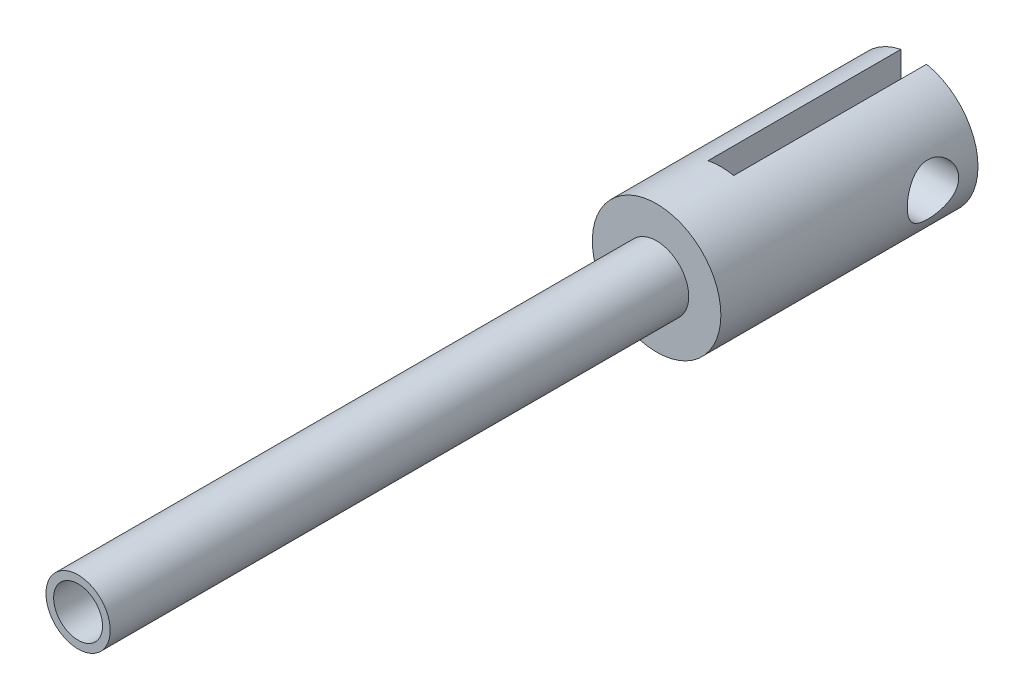
ISO-10303-21;
HEADER;
FILE_DESCRIPTION(('STEP AP214'),'2;1');
FILE_NAME('part.step','',(''),(''),'','','');
FILE_SCHEMA(('AUTOMOTIVE_DESIGN { 1 0 10303 214 1 1 1 1 }'));
ENDSEC;
DATA;
#1=APPLICATION_CONTEXT('core data for automotive mechanical design processes');
#2=APPLICATION_PROTOCOL_DEFINITION('international standard','automotive_design',2000,#1);
#3=PRODUCT_CONTEXT('',#1,'mechanical');
#4=PRODUCT('Part','Part','',(#3));
#5=PRODUCT_RELATED_PRODUCT_CATEGORY('part','',(#4));
#6=PRODUCT_DEFINITION_FORMATION('','',#4);
#7=PRODUCT_DEFINITION_CONTEXT('part definition',#1,'design');
#8=PRODUCT_DEFINITION('design','',#6,#7);
#9=PRODUCT_DEFINITION_SHAPE('','',#8);
#10=(LENGTH_UNIT() NAMED_UNIT(*) SI_UNIT(.MILLI.,.METRE.));
#11=(NAMED_UNIT(*) PLANE_ANGLE_UNIT() SI_UNIT($,.RADIAN.));
#12=(NAMED_UNIT(*) SI_UNIT($,.STERADIAN.) SOLID_ANGLE_UNIT());
#13=UNCERTAINTY_MEASURE_WITH_UNIT(LENGTH_MEASURE(1.E-05),#10,'distance_accuracy_value','');
#14=(GEOMETRIC_REPRESENTATION_CONTEXT(3) GLOBAL_UNCERTAINTY_ASSIGNED_CONTEXT((#13)) GLOBAL_UNIT_ASSIGNED_CONTEXT((#10,
#11,#12)) REPRESENTATION_CONTEXT('',''));
#15=CARTESIAN_POINT('',(0.,0.,0.));
#16=DIRECTION('',(0.,0.,1.));
#17=DIRECTION('',(1.,0.,0.));
#18=AXIS2_PLACEMENT_3D('',#15,#16,#17);
#19=CARTESIAN_POINT('',(0.,0.,40.));
#20=DIRECTION('',(0.,0.,-1.));
#21=DIRECTION('',(-1.,0.,0.));
#22=AXIS2_PLACEMENT_3D('',#19,#20,#21);
#23=CYLINDRICAL_SURFACE('',#22,10.);
#24=CARTESIAN_POINT('',(0.,0.,40.));
#25=DIRECTION('',(0.,0.,1.));
#26=DIRECTION('',(1.,0.,0.));
#27=AXIS2_PLACEMENT_3D('',#24,#25,#26);
#28=CIRCLE('',#27,10.);
#29=CARTESIAN_POINT('',(10.,0.,40.));
#30=VERTEX_POINT('',#29);
#31=EDGE_CURVE('E85',#30,#30,#28,.T.);
#32=ORIENTED_EDGE('',*,*,#31,.F.);
#33=EDGE_LOOP('',(#32));
#34=FACE_BOUND('',#33,.T.);
#35=DIRECTION('',(0.,0.,-1.));
#36=VECTOR('',#35,1.);
#37=CARTESIAN_POINT('',(2.,-9.79795897113271,40.));
#38=LINE('',#37,#36);
#39=CARTESIAN_POINT('',(2.,-9.79795897113272,0.));
#40=VERTEX_POINT('',#39);
#41=CARTESIAN_POINT('',(2.,-9.79795897113272,30.));
#42=VERTEX_POINT('',#41);
#43=EDGE_CURVE('E112',#40,#42,#38,.F.);
#44=ORIENTED_EDGE('',*,*,#43,.F.);
#45=CARTESIAN_POINT('',(0.,0.,0.));
#46=DIRECTION('',(0.,0.,1.));
#47=DIRECTION('',(1.,0.,0.));
#48=AXIS2_PLACEMENT_3D('',#45,#46,#47);
#49=CIRCLE('',#48,10.);
#50=CARTESIAN_POINT('',(2.,9.79795897113271,0.));
#51=VERTEX_POINT('',#50);
#52=EDGE_CURVE('E96',#40,#51,#49,.T.);
#53=ORIENTED_EDGE('',*,*,#52,.T.);
#54=DIRECTION('',(0.,0.,-1.));
#55=VECTOR('',#54,1.);
#56=CARTESIAN_POINT('',(2.,9.79795897113271,40.));
#57=LINE('',#56,#55);
#58=CARTESIAN_POINT('',(2.,9.79795897113271,30.));
#59=VERTEX_POINT('',#58);
#60=EDGE_CURVE('E101',#59,#51,#57,.T.);
#61=ORIENTED_EDGE('',*,*,#60,.F.);
#62=CARTESIAN_POINT('',(0.,0.,30.));
#63=DIRECTION('',(0.,0.,-1.));
#64=DIRECTION('',(-1.,0.,0.));
#65=AXIS2_PLACEMENT_3D('',#62,#63,#64);
#66=CIRCLE('',#65,10.);
#67=CARTESIAN_POINT('',(-2.,9.79795897113271,30.));
#68=VERTEX_POINT('',#67);
#69=EDGE_CURVE('E92',#68,#59,#66,.T.);
#70=ORIENTED_EDGE('',*,*,#69,.F.);
#71=DIRECTION('',(0.,0.,-1.));
#72=VECTOR('',#71,1.);
#73=CARTESIAN_POINT('',(-2.,9.79795897113271,40.));
#74=LINE('',#73,#72);
#75=CARTESIAN_POINT('',(-2.,9.79795897113271,0.));
#76=VERTEX_POINT('',#75);
#77=EDGE_CURVE('E80',#76,#68,#74,.F.);
#78=ORIENTED_EDGE('',*,*,#77,.F.);
#79=CARTESIAN_POINT('',(-2.,-9.79795897113271,0.));
#80=VERTEX_POINT('',#79);
#81=EDGE_CURVE('E90',#76,#80,#49,.T.);
#82=ORIENTED_EDGE('',*,*,#81,.T.);
#83=DIRECTION('',(0.,0.,-1.));
#84=VECTOR('',#83,1.);
#85=CARTESIAN_POINT('',(-2.,-9.79795897113271,40.));
#86=LINE('',#85,#84);
#87=CARTESIAN_POINT('',(-2.,-9.79795897113272,30.));
#88=VERTEX_POINT('',#87);
#89=EDGE_CURVE('E53',#88,#80,#86,.T.);
#90=ORIENTED_EDGE('',*,*,#89,.F.);
#91=EDGE_CURVE('E45',#42,#88,#66,.T.);
#92=ORIENTED_EDGE('',*,*,#91,.F.);
#93=EDGE_LOOP('',(#44,#53,#61,#70,#78,#82,#90,#92));
#94=FACE_BOUND('',#93,.T.);
#95=CARTESIAN_POINT('',(10.,0.,11.));
#96=CARTESIAN_POINT('',(9.99999886871264,-0.107549581345537,10.9999984250671));
#97=CARTESIAN_POINT('',(9.99825999367799,-0.215132147940362,10.9956563289198));
#98=CARTESIAN_POINT('',(9.99134740691108,-0.429535200549549,10.9783266172161));
#99=CARTESIAN_POINT('',(9.98617152790588,-0.536355162703302,10.9653335465974));
#100=CARTESIAN_POINT('',(9.97250573560117,-0.748635856497417,10.9307919654494));
#101=CARTESIAN_POINT('',(9.96400865312144,-0.854093134440869,10.9092249453802));
#102=CARTESIAN_POINT('',(9.94393017211574,-1.0626676111401,10.8577582695632));
#103=CARTESIAN_POINT('',(9.932347522545,-1.1657838422726,10.8278552337447));
#104=CARTESIAN_POINT('',(9.89349112162205,-1.46979509681069,10.726277191284));
#105=CARTESIAN_POINT('',(9.86204458846134,-1.66629107461992,10.6425781809936));
#106=CARTESIAN_POINT('',(9.79113035538708,-2.04217417878102,10.4459537826502));
#107=CARTESIAN_POINT('',(9.75166544086262,-2.22156721456799,10.3330385398851));
#108=CARTESIAN_POINT('',(9.66661825353092,-2.56699339938209,10.0755312454783));
#109=CARTESIAN_POINT('',(9.62084608086599,-2.73212223266508,9.92978728942438));
#110=CARTESIAN_POINT('',(9.52921139577231,-3.03635232313263,9.61319939084796));
#111=CARTESIAN_POINT('',(9.48334885017047,-3.17544084661153,9.44234324098346));
#112=CARTESIAN_POINT('',(9.39445587657958,-3.42974847409894,9.0711440314337));
#113=CARTESIAN_POINT('',(9.35164233015934,-3.54362978572887,8.86982707393626));
#114=CARTESIAN_POINT('',(9.2766729328807,-3.73550961465234,8.44892715719913));
#115=CARTESIAN_POINT('',(9.24451202207146,-3.81352517485723,8.2293529322586));
#116=CARTESIAN_POINT('',(9.19652715590089,-3.92779760260541,7.78857534431419));
#117=CARTESIAN_POINT('',(9.18002840771385,-3.96578791979826,7.56789753191187));
#118=CARTESIAN_POINT('',(9.16328008038142,-4.00434593508728,7.12273000032267));
#119=CARTESIAN_POINT('',(9.16302251073202,-4.00493203570086,6.89824220998889));
#120=CARTESIAN_POINT('',(9.17821000534301,-3.9699787321474,6.46848665777683));
#121=CARTESIAN_POINT('',(9.19256349925666,-3.93695062778272,6.26296857123435));
#122=CARTESIAN_POINT('',(9.23352375055553,-3.83989376129508,5.86068088764966));
#123=CARTESIAN_POINT('',(9.26013264599921,-3.77585958980135,5.66391282369374));
#124=CARTESIAN_POINT('',(9.32318970221162,-3.6173894649114,5.27996432770806));
#125=CARTESIAN_POINT('',(9.35982758573424,-3.52235972457939,5.09306152191752));
#126=CARTESIAN_POINT('',(9.43876232767927,-3.30501292151569,4.73716836724996));
#127=CARTESIAN_POINT('',(9.48106130910412,-3.1826856102159,4.56818478118693));
#128=CARTESIAN_POINT('',(9.57053473488081,-2.90310119889356,4.23918054240404));
#129=CARTESIAN_POINT('',(9.61783329953252,-2.74387492593717,4.08086254111012));
#130=CARTESIAN_POINT('',(9.70919649915615,-2.40062885486449,3.79263104399377));
#131=CARTESIAN_POINT('',(9.75326048890393,-2.21660413066998,3.66272320517883));
#132=CARTESIAN_POINT('',(9.83429362529358,-1.82415530521056,3.43276510516893));
#133=CARTESIAN_POINT('',(9.87110540190899,-1.61532098269266,3.33335543760606));
#134=CARTESIAN_POINT('',(9.93229656657448,-1.18204753096606,3.17166427784373));
#135=CARTESIAN_POINT('',(9.95668226924746,-0.9576163936994,3.10936392488513));
#136=CARTESIAN_POINT('',(9.98912279013839,-0.513791775215592,3.02710340916064));
#137=CARTESIAN_POINT('',(9.99805891667034,-0.294886587971141,3.00485509149294));
#138=CARTESIAN_POINT('',(10.0013695702126,0.143690619615705,2.99657379894272));
#139=CARTESIAN_POINT('',(9.99574787164577,0.363362426448182,3.01053143690481));
#140=CARTESIAN_POINT('',(9.97115134127512,0.786865478243654,3.07258350510414));
#141=CARTESIAN_POINT('',(9.95278782691064,0.990964983549761,3.11911596070253));
#142=CARTESIAN_POINT('',(9.90518882810983,1.38827085612275,3.24287141661905));
#143=CARTESIAN_POINT('',(9.87595194712999,1.58147582045412,3.32009835933521));
#144=CARTESIAN_POINT('',(9.80833189541687,1.95815757162884,3.50556987936211));
#145=CARTESIAN_POINT('',(9.76969631959847,2.14115604549353,3.61469094409467));
#146=CARTESIAN_POINT('',(9.68746729490809,2.4868871825104,3.85988064780291));
#147=CARTESIAN_POINT('',(9.64387186219643,2.64961168158684,3.99596008581391));
#148=CARTESIAN_POINT('',(9.55290235277181,2.96144608598878,4.30174002593264));
#149=CARTESIAN_POINT('',(9.50546882853787,3.10894786734725,4.47306708314085));
#150=CARTESIAN_POINT('',(9.4148334583058,3.37350239509234,4.83888016589028));
#151=CARTESIAN_POINT('',(9.37163231039242,3.4905501236659,5.03337000019944));
#152=CARTESIAN_POINT('',(9.2942859982933,3.69161500286277,5.44292338967332));
#153=CARTESIAN_POINT('',(9.2602326182174,3.77530118531766,5.6581680002435));
#154=CARTESIAN_POINT('',(9.20647346903737,3.90459244315908,6.10146730161278));
#155=CARTESIAN_POINT('',(9.1867571119746,3.95022562452797,6.32951240484181));
#156=CARTESIAN_POINT('',(9.16543518780389,3.99943122157416,6.77425580984401));
#157=CARTESIAN_POINT('',(9.16262842667612,4.00579411777209,6.99058970189503));
#158=CARTESIAN_POINT('',(9.17229671415009,3.98360636538274,7.42108969272114));
#159=CARTESIAN_POINT('',(9.18476982225497,3.9550601501471,7.63525606328247));
#160=CARTESIAN_POINT('',(9.2225330048627,3.86614256488129,8.0466644608903));
#161=CARTESIAN_POINT('',(9.2472967218297,3.80707437387706,8.24424084622109));
#162=CARTESIAN_POINT('',(9.30647993934966,3.66001151041638,8.6267569617897));
#163=CARTESIAN_POINT('',(9.34090210615105,3.5720088493455,8.81169318511131));
#164=CARTESIAN_POINT('',(9.41797252826471,3.36374310804133,9.17522041070949));
#165=CARTESIAN_POINT('',(9.46097893410836,3.24192140926543,9.35284183068834));
#166=CARTESIAN_POINT('',(9.54927479921251,2.97179350239177,9.68598214262481));
#167=CARTESIAN_POINT('',(9.59456494363941,2.82347931168581,9.84149434728997));
#168=CARTESIAN_POINT('',(9.68587647140965,2.49297412446699,10.1364235925306));
#169=CARTESIAN_POINT('',(9.73175488236393,2.30921017071955,10.2741433839823));
#170=CARTESIAN_POINT('',(9.7949502762577,2.01716584575533,10.4560481089375));
#171=CARTESIAN_POINT('',(9.81509269692655,1.91699501972424,10.512607063853));
#172=CARTESIAN_POINT('',(9.85294835133019,1.7118011098248,10.6170379954053));
#173=CARTESIAN_POINT('',(9.87066269647665,1.60678027559742,10.664913949808));
#174=CARTESIAN_POINT('',(9.9028559935491,1.39454646904328,10.750747984685));
#175=CARTESIAN_POINT('',(9.91738778532477,1.28740777135872,10.7888701547472));
#176=CARTESIAN_POINT('',(9.94319722915714,1.06995577523383,10.8559213477213));
#177=CARTESIAN_POINT('',(9.95447639837582,0.959643983352618,10.8848546573499));
#178=CARTESIAN_POINT('',(9.97343330649399,0.736945215856835,10.933174836149));
#179=CARTESIAN_POINT('',(9.98112017494336,0.62456426359128,10.952585911645));
#180=CARTESIAN_POINT('',(9.99270031578293,0.398419132407602,10.9817385706662));
#181=CARTESIAN_POINT('',(9.99659628445551,0.284655994966352,10.9914870268343));
#182=CARTESIAN_POINT('',(9.99951445883957,0.113830463425492,10.9987858955734));
#183=CARTESIAN_POINT('',(10.0000005987258,0.0569198512645293,11.0000008335221));
#184=CARTESIAN_POINT('',(10.,0.,11.));
#185=B_SPLINE_CURVE_WITH_KNOTS('',3,(#95,#96,#97,#98,#99,#100,#101,#102,#103,#104,#105,#106,
#107,#108,#109,#110,#111,#112,#113,#114,#115,#116,#117,#118,#119,#120,#121,#122,#123,#124,#125,
#126,#127,#128,#129,#130,#131,#132,#133,#134,#135,#136,#137,#138,#139,#140,#141,#142,#143,#144,
#145,#146,#147,#148,#149,#150,#151,#152,#153,#154,#155,#156,#157,#158,#159,#160,#161,#162,#163,
#164,#165,#166,#167,#168,#169,#170,#171,#172,#173,#174,#175,#176,#177,#178,#179,#180,#181,#182,
#183,#184),.UNSPECIFIED.,.T.,.F.,(4,2,2,2,2,2,2,2,2,2,2,2,2,2,2,2,2,2,2,2,2,2,2,2,2,2,2,2,2,2,2,
2,2,2,2,2,2,2,2,2,2,2,2,2,4),(0.,0.322603993422155,0.645411604786482,0.968919914471235,
1.29255959093094,1.93701523385824,2.58124739027476,3.25313995292302,3.9253602176033,
4.62749749529941,5.32930078128044,5.99927442509165,6.66891844572484,7.29195888698823,
7.9151080641227,8.55097484497807,9.18708075776541,9.87235930273289,10.5577741757964,
11.2567305822579,11.9553314412776,12.6125760095619,13.2696501904034,13.8972014302891,
14.5248332988777,15.171662586967,15.8187515089811,16.50856181149,17.1984856998767,
17.8950932218183,18.5911857719204,19.2371857868567,19.8831037702627,20.5034786899771,
21.124025035105,21.7801016801356,22.4363763459696,23.1352007896785,23.4851924266232,
23.8350233218042,24.1785111324565,24.52183846562,24.8642884495951,25.2064946871486,
25.3772305569977),.UNSPECIFIED.);
#186=CARTESIAN_POINT('',(10.,0.,11.));
#187=VERTEX_POINT('',#186);
#188=EDGE_CURVE('E149',#187,#187,#185,.T.);
#189=ORIENTED_EDGE('',*,*,#188,.F.);
#190=EDGE_LOOP('',(#189));
#191=FACE_BOUND('',#190,.T.);
#192=CARTESIAN_POINT('',(-10.,0.,11.));
#193=CARTESIAN_POINT('',(-9.99999886871264,0.107549581345536,10.9999984250671));
#194=CARTESIAN_POINT('',(-9.99825999367799,0.215132147940361,10.9956563289198));
#195=CARTESIAN_POINT('',(-9.99134740691108,0.429535200549548,10.9783266172161));
#196=CARTESIAN_POINT('',(-9.98617152790588,0.536355162703301,10.9653335465974));
#197=CARTESIAN_POINT('',(-9.97250573560117,0.748635856497416,10.9307919654494));
#198=CARTESIAN_POINT('',(-9.96400865312144,0.854093134440869,10.9092249453802));
#199=CARTESIAN_POINT('',(-9.94393017211574,1.0626676111401,10.8577582695632));
#200=CARTESIAN_POINT('',(-9.932347522545,1.16578384227259,10.8278552337447));
#201=CARTESIAN_POINT('',(-9.89349112162205,1.46979509681069,10.726277191284));
#202=CARTESIAN_POINT('',(-9.86204458846134,1.66629107461992,10.6425781809936));
#203=CARTESIAN_POINT('',(-9.79113035538708,2.04217417878102,10.4459537826502));
#204=CARTESIAN_POINT('',(-9.75166544086262,2.22156721456798,10.3330385398851));
#205=CARTESIAN_POINT('',(-9.66661825353092,2.56699339938209,10.0755312454783));
#206=CARTESIAN_POINT('',(-9.62084608086599,2.73212223266508,9.92978728942438));
#207=CARTESIAN_POINT('',(-9.52921139577231,3.03635232313263,9.61319939084796));
#208=CARTESIAN_POINT('',(-9.48334885017047,3.17544084661153,9.44234324098346));
#209=CARTESIAN_POINT('',(-9.39445587657958,3.42974847409894,9.0711440314337));
#210=CARTESIAN_POINT('',(-9.35164233015934,3.54362978572887,8.86982707393626));
#211=CARTESIAN_POINT('',(-9.2766729328807,3.73550961465234,8.44892715719913));
#212=CARTESIAN_POINT('',(-9.24451202207146,3.81352517485723,8.2293529322586));
#213=CARTESIAN_POINT('',(-9.19652715590089,3.92779760260541,7.7885753443142));
#214=CARTESIAN_POINT('',(-9.18002840771385,3.96578791979826,7.56789753191188));
#215=CARTESIAN_POINT('',(-9.16328008038143,4.00434593508728,7.12273000032267));
#216=CARTESIAN_POINT('',(-9.16302251073203,4.00493203570086,6.89824220998889));
#217=CARTESIAN_POINT('',(-9.17821000534301,3.9699787321474,6.46848665777683));
#218=CARTESIAN_POINT('',(-9.19256349925666,3.93695062778272,6.26296857123435));
#219=CARTESIAN_POINT('',(-9.23352375055553,3.83989376129508,5.86068088764966));
#220=CARTESIAN_POINT('',(-9.26013264599921,3.77585958980135,5.66391282369374));
#221=CARTESIAN_POINT('',(-9.32318970221162,3.6173894649114,5.27996432770806));
#222=CARTESIAN_POINT('',(-9.35982758573424,3.52235972457939,5.09306152191752));
#223=CARTESIAN_POINT('',(-9.43876232767927,3.30501292151569,4.73716836724996));
#224=CARTESIAN_POINT('',(-9.48106130910412,3.18268561021589,4.56818478118693));
#225=CARTESIAN_POINT('',(-9.57053473488081,2.90310119889356,4.23918054240404));
#226=CARTESIAN_POINT('',(-9.61783329953252,2.74387492593716,4.08086254111012));
#227=CARTESIAN_POINT('',(-9.70919649915615,2.40062885486449,3.79263104399377));
#228=CARTESIAN_POINT('',(-9.75326048890393,2.21660413066997,3.66272320517883));
#229=CARTESIAN_POINT('',(-9.83429362529359,1.82415530521055,3.43276510516893));
#230=CARTESIAN_POINT('',(-9.87110540190899,1.61532098269266,3.33335543760606));
#231=CARTESIAN_POINT('',(-9.93229656657448,1.18204753096606,3.17166427784373));
#232=CARTESIAN_POINT('',(-9.95668226924746,0.957616393699398,3.10936392488513));
#233=CARTESIAN_POINT('',(-9.98912279013839,0.513791775215589,3.02710340916064));
#234=CARTESIAN_POINT('',(-9.99805891667034,0.294886587971139,3.00485509149294));
#235=CARTESIAN_POINT('',(-10.0013695702126,-0.143690619615708,2.99657379894272));
#236=CARTESIAN_POINT('',(-9.99574787164577,-0.363362426448185,3.01053143690481));
#237=CARTESIAN_POINT('',(-9.97115134127512,-0.786865478243656,3.07258350510414));
#238=CARTESIAN_POINT('',(-9.95278782691064,-0.990964983549763,3.11911596070253));
#239=CARTESIAN_POINT('',(-9.90518882810983,-1.38827085612275,3.24287141661905));
#240=CARTESIAN_POINT('',(-9.87595194712999,-1.58147582045412,3.32009835933521));
#241=CARTESIAN_POINT('',(-9.80833189541687,-1.95815757162884,3.50556987936211));
#242=CARTESIAN_POINT('',(-9.76969631959847,-2.14115604549353,3.61469094409467));
#243=CARTESIAN_POINT('',(-9.68746729490809,-2.4868871825104,3.85988064780291));
#244=CARTESIAN_POINT('',(-9.64387186219643,-2.64961168158685,3.99596008581391));
#245=CARTESIAN_POINT('',(-9.55290235277181,-2.96144608598878,4.30174002593264));
#246=CARTESIAN_POINT('',(-9.50546882853787,-3.10894786734725,4.47306708314085));
#247=CARTESIAN_POINT('',(-9.4148334583058,-3.37350239509234,4.83888016589028));
#248=CARTESIAN_POINT('',(-9.37163231039242,-3.4905501236659,5.03337000019944));
#249=CARTESIAN_POINT('',(-9.2942859982933,-3.69161500286277,5.44292338967332));
#250=CARTESIAN_POINT('',(-9.2602326182174,-3.77530118531766,5.6581680002435));
#251=CARTESIAN_POINT('',(-9.20647346903736,-3.90459244315908,6.10146730161278));
#252=CARTESIAN_POINT('',(-9.18675711197461,-3.95022562452798,6.32951240484181));
#253=CARTESIAN_POINT('',(-9.16543518780389,-3.99943122157417,6.77425580984401));
#254=CARTESIAN_POINT('',(-9.16262842667612,-4.0057941177721,6.99058970189503));
#255=CARTESIAN_POINT('',(-9.17229671415009,-3.98360636538274,7.42108969272114));
#256=CARTESIAN_POINT('',(-9.18476982225497,-3.9550601501471,7.63525606328247));
#257=CARTESIAN_POINT('',(-9.2225330048627,-3.86614256488129,8.0466644608903));
#258=CARTESIAN_POINT('',(-9.2472967218297,-3.80707437387706,8.24424084622109));
#259=CARTESIAN_POINT('',(-9.30647993934966,-3.66001151041638,8.6267569617897));
#260=CARTESIAN_POINT('',(-9.34090210615105,-3.5720088493455,8.81169318511131));
#261=CARTESIAN_POINT('',(-9.41797252826471,-3.36374310804133,9.17522041070949));
#262=CARTESIAN_POINT('',(-9.46097893410836,-3.24192140926543,9.35284183068834));
#263=CARTESIAN_POINT('',(-9.54927479921251,-2.97179350239177,9.68598214262481));
#264=CARTESIAN_POINT('',(-9.59456494363941,-2.82347931168581,9.84149434728997));
#265=CARTESIAN_POINT('',(-9.68587647140964,-2.492974124467,10.1364235925306));
#266=CARTESIAN_POINT('',(-9.73175488236393,-2.30921017071955,10.2741433839823));
#267=CARTESIAN_POINT('',(-9.7949502762577,-2.01716584575533,10.4560481089375));
#268=CARTESIAN_POINT('',(-9.81509269692655,-1.91699501972425,10.512607063853));
#269=CARTESIAN_POINT('',(-9.85294835133019,-1.7118011098248,10.6170379954053));
#270=CARTESIAN_POINT('',(-9.87066269647665,-1.60678027559742,10.664913949808));
#271=CARTESIAN_POINT('',(-9.9028559935491,-1.39454646904328,10.750747984685));
#272=CARTESIAN_POINT('',(-9.91738778532477,-1.28740777135871,10.7888701547472));
#273=CARTESIAN_POINT('',(-9.94319722915714,-1.06995577523383,10.8559213477213));
#274=CARTESIAN_POINT('',(-9.95447639837582,-0.959643983352615,10.8848546573499));
#275=CARTESIAN_POINT('',(-9.97343330649399,-0.736945215856833,10.933174836149));
#276=CARTESIAN_POINT('',(-9.98112017494336,-0.624564263591278,10.952585911645));
#277=CARTESIAN_POINT('',(-9.99270031578293,-0.398419132407602,10.9817385706662));
#278=CARTESIAN_POINT('',(-9.99659628445551,-0.284655994966352,10.9914870268343));
#279=CARTESIAN_POINT('',(-9.99951445883957,-0.113830463425492,10.9987858955734));
#280=CARTESIAN_POINT('',(-10.0000005987258,-0.0569198512645299,11.0000008335221));
#281=CARTESIAN_POINT('',(-10.,0.,11.));
#282=B_SPLINE_CURVE_WITH_KNOTS('',3,(#192,#193,#194,#195,#196,#197,#198,#199,#200,#201,#202,
#203,#204,#205,#206,#207,#208,#209,#210,#211,#212,#213,#214,#215,#216,#217,#218,#219,#220,#221,
#222,#223,#224,#225,#226,#227,#228,#229,#230,#231,#232,#233,#234,#235,#236,#237,#238,#239,#240,
#241,#242,#243,#244,#245,#246,#247,#248,#249,#250,#251,#252,#253,#254,#255,#256,#257,#258,#259,
#260,#261,#262,#263,#264,#265,#266,#267,#268,#269,#270,#271,#272,#273,#274,#275,#276,#277,#278,
#279,#280,#281),.UNSPECIFIED.,.T.,.F.,(4,2,2,2,2,2,2,2,2,2,2,2,2,2,2,2,2,2,2,2,2,2,2,2,2,2,2,2,
2,2,2,2,2,2,2,2,2,2,2,2,2,2,2,2,4),(0.,0.322603993422155,0.645411604786482,0.968919914471235,
1.29255959093094,1.93701523385824,2.58124739027476,3.25313995292302,3.9253602176033,
4.62749749529941,5.32930078128043,5.99927442509165,6.66891844572483,7.29195888698823,
7.9151080641227,8.55097484497807,9.18708075776541,9.87235930273289,10.5577741757964,
11.2567305822579,11.9553314412776,12.6125760095619,13.2696501904034,13.8972014302891,
14.5248332988777,15.171662586967,15.8187515089811,16.50856181149,17.1984856998767,
17.8950932218183,18.5911857719204,19.2371857868567,19.8831037702627,20.5034786899771,
21.124025035105,21.7801016801356,22.4363763459696,23.1352007896785,23.4851924266232,
23.8350233218042,24.1785111324565,24.52183846562,24.8642884495951,25.2064946871486,
25.3772305569977),.UNSPECIFIED.);
#283=CARTESIAN_POINT('',(-10.,0.,11.));
#284=VERTEX_POINT('',#283);
#285=EDGE_CURVE('E110',#284,#284,#282,.T.);
#286=ORIENTED_EDGE('',*,*,#285,.F.);
#287=EDGE_LOOP('',(#286));
#288=FACE_BOUND('',#287,.T.);
#289=ADVANCED_FACE('F36',(#34,#94,#191,#288),#23,.T.);
#290=CARTESIAN_POINT('',(0.,0.,0.));
#291=DIRECTION('',(0.,0.,1.));
#292=DIRECTION('',(1.,0.,0.));
#293=AXIS2_PLACEMENT_3D('',#290,#291,#292);
#294=PLANE('',#293);
#295=DIRECTION('',(0.,-1.,0.));
#296=VECTOR('',#295,1.);
#297=CARTESIAN_POINT('',(2.,0.,0.));
#298=LINE('',#297,#296);
#299=EDGE_CURVE('E61',#51,#40,#298,.T.);
#300=ORIENTED_EDGE('',*,*,#299,.F.);
#301=ORIENTED_EDGE('',*,*,#52,.F.);
#302=EDGE_LOOP('',(#300,#301));
#303=FACE_BOUND('',#302,.T.);
#304=ADVANCED_FACE('F119',(#303),#294,.F.);
#305=DIRECTION('',(0.,1.,0.));
#306=VECTOR('',#305,1.);
#307=CARTESIAN_POINT('',(-2.,0.,0.));
#308=LINE('',#307,#306);
#309=EDGE_CURVE('E77',#80,#76,#308,.T.);
#310=ORIENTED_EDGE('',*,*,#309,.F.);
#311=ORIENTED_EDGE('',*,*,#81,.F.);
#312=EDGE_LOOP('',(#310,#311));
#313=FACE_BOUND('',#312,.T.);
#314=ADVANCED_FACE('F95',(#313),#294,.F.);
#315=CARTESIAN_POINT('',(0.,0.,40.));
#316=DIRECTION('',(0.,0.,1.));
#317=DIRECTION('',(1.,0.,0.));
#318=AXIS2_PLACEMENT_3D('',#315,#316,#317);
#319=PLANE('',#318);
#320=CARTESIAN_POINT('',(0.,0.,40.));
#321=DIRECTION('',(0.,0.,1.));
#322=DIRECTION('',(1.,0.,0.));
#323=AXIS2_PLACEMENT_3D('',#320,#321,#322);
#324=CIRCLE('',#323,5.);
#325=CARTESIAN_POINT('',(5.,0.,40.));
#326=VERTEX_POINT('',#325);
#327=EDGE_CURVE('E11',#326,#326,#324,.T.);
#328=ORIENTED_EDGE('',*,*,#327,.F.);
#329=EDGE_LOOP('',(#328));
#330=FACE_BOUND('',#329,.T.);
#331=ORIENTED_EDGE('',*,*,#31,.T.);
#332=EDGE_LOOP('',(#331));
#333=FACE_BOUND('',#332,.T.);
#334=ADVANCED_FACE('F125',(#330,#333),#319,.T.);
#335=CARTESIAN_POINT('',(-2.,20.,30.));
#336=DIRECTION('',(0.,0.,-1.));
#337=DIRECTION('',(-1.,0.,0.));
#338=AXIS2_PLACEMENT_3D('',#335,#336,#337);
#339=PLANE('',#338);
#340=ORIENTED_EDGE('',*,*,#69,.T.);
#341=DIRECTION('',(0.,-1.,0.));
#342=VECTOR('',#341,1.);
#343=CARTESIAN_POINT('',(2.,20.,30.));
#344=LINE('',#343,#342);
#345=EDGE_CURVE('E93',#59,#42,#344,.T.);
#346=ORIENTED_EDGE('',*,*,#345,.T.);
#347=ORIENTED_EDGE('',*,*,#91,.T.);
#348=DIRECTION('',(0.,-1.,0.));
#349=VECTOR('',#348,1.);
#350=CARTESIAN_POINT('',(-2.,20.,30.));
#351=LINE('',#350,#349);
#352=EDGE_CURVE('E109',#68,#88,#351,.T.);
#353=ORIENTED_EDGE('',*,*,#352,.F.);
#354=EDGE_LOOP('',(#340,#346,#347,#353));
#355=FACE_BOUND('',#354,.T.);
#356=ADVANCED_FACE('F108',(#355),#339,.T.);
#357=CARTESIAN_POINT('',(2.,20.,30.));
#358=DIRECTION('',(-1.,0.,0.));
#359=DIRECTION('',(0.,0.,1.));
#360=AXIS2_PLACEMENT_3D('',#357,#358,#359);
#361=PLANE('',#360);
#362=CARTESIAN_POINT('',(2.,0.,7.));
#363=DIRECTION('',(-1.,0.,0.));
#364=DIRECTION('',(0.,0.,1.));
#365=AXIS2_PLACEMENT_3D('',#362,#363,#364);
#366=CIRCLE('',#365,4.);
#367=CARTESIAN_POINT('',(2.,0.,11.));
#368=VERTEX_POINT('',#367);
#369=EDGE_CURVE('E162',#368,#368,#366,.F.);
#370=ORIENTED_EDGE('',*,*,#369,.T.);
#371=EDGE_LOOP('',(#370));
#372=FACE_BOUND('',#371,.T.);
#373=ORIENTED_EDGE('',*,*,#60,.T.);
#374=ORIENTED_EDGE('',*,*,#299,.T.);
#375=ORIENTED_EDGE('',*,*,#43,.T.);
#376=ORIENTED_EDGE('',*,*,#345,.F.);
#377=EDGE_LOOP('',(#373,#374,#375,#376));
#378=FACE_BOUND('',#377,.T.);
#379=ADVANCED_FACE('F116',(#372,#378),#361,.T.);
#380=CARTESIAN_POINT('',(-2.,20.,0.));
#381=DIRECTION('',(1.,0.,0.));
#382=DIRECTION('',(0.,0.,-1.));
#383=AXIS2_PLACEMENT_3D('',#380,#381,#382);
#384=PLANE('',#383);
#385=CARTESIAN_POINT('',(-2.,0.,7.));
#386=DIRECTION('',(1.,0.,0.));
#387=DIRECTION('',(0.,0.,-1.));
#388=AXIS2_PLACEMENT_3D('',#385,#386,#387);
#389=CIRCLE('',#388,4.);
#390=CARTESIAN_POINT('',(-2.,0.,3.));
#391=VERTEX_POINT('',#390);
#392=EDGE_CURVE('E40',#391,#391,#389,.F.);
#393=ORIENTED_EDGE('',*,*,#392,.T.);
#394=EDGE_LOOP('',(#393));
#395=FACE_BOUND('',#394,.T.);
#396=ORIENTED_EDGE('',*,*,#89,.T.);
#397=ORIENTED_EDGE('',*,*,#309,.T.);
#398=ORIENTED_EDGE('',*,*,#77,.T.);
#399=ORIENTED_EDGE('',*,*,#352,.T.);
#400=EDGE_LOOP('',(#396,#397,#398,#399));
#401=FACE_BOUND('',#400,.T.);
#402=ADVANCED_FACE('F79',(#395,#401),#384,.T.);
#403=CARTESIAN_POINT('',(20.,0.,7.));
#404=DIRECTION('',(-1.,0.,0.));
#405=DIRECTION('',(0.,0.,1.));
#406=AXIS2_PLACEMENT_3D('',#403,#404,#405);
#407=CYLINDRICAL_SURFACE('',#406,4.);
#408=ORIENTED_EDGE('',*,*,#392,.F.);
#409=EDGE_LOOP('',(#408));
#410=FACE_BOUND('',#409,.T.);
#411=ORIENTED_EDGE('',*,*,#285,.T.);
#412=EDGE_LOOP('',(#411));
#413=FACE_BOUND('',#412,.T.);
#414=ADVANCED_FACE('F138',(#410,#413),#407,.F.);
#415=ORIENTED_EDGE('',*,*,#369,.F.);
#416=EDGE_LOOP('',(#415));
#417=FACE_BOUND('',#416,.T.);
#418=ORIENTED_EDGE('',*,*,#188,.T.);
#419=EDGE_LOOP('',(#418));
#420=FACE_BOUND('',#419,.T.);
#421=ADVANCED_FACE('F143',(#417,#420),#407,.F.);
#422=CARTESIAN_POINT('',(0.,0.,130.));
#423=DIRECTION('',(0.,0.,-1.));
#424=DIRECTION('',(-1.,0.,0.));
#425=AXIS2_PLACEMENT_3D('',#422,#423,#424);
#426=CYLINDRICAL_SURFACE('',#425,5.);
#427=CARTESIAN_POINT('',(0.,0.,130.));
#428=DIRECTION('',(0.,0.,1.));
#429=DIRECTION('',(1.,0.,0.));
#430=AXIS2_PLACEMENT_3D('',#427,#428,#429);
#431=CIRCLE('',#430,5.);
#432=CARTESIAN_POINT('',(5.,0.,130.));
#433=VERTEX_POINT('',#432);
#434=EDGE_CURVE('E168',#433,#433,#431,.T.);
#435=ORIENTED_EDGE('',*,*,#434,.F.);
#436=EDGE_LOOP('',(#435));
#437=FACE_BOUND('',#436,.T.);
#438=ORIENTED_EDGE('',*,*,#327,.T.);
#439=EDGE_LOOP('',(#438));
#440=FACE_BOUND('',#439,.T.);
#441=ADVANCED_FACE('F145',(#437,#440),#426,.T.);
#442=CARTESIAN_POINT('',(0.,0.,130.));
#443=DIRECTION('',(0.,0.,1.));
#444=DIRECTION('',(1.,0.,0.));
#445=AXIS2_PLACEMENT_3D('',#442,#443,#444);
#446=PLANE('',#445);
#447=CARTESIAN_POINT('',(0.,0.,130.));
#448=DIRECTION('',(0.,0.,1.));
#449=DIRECTION('',(1.,0.,0.));
#450=AXIS2_PLACEMENT_3D('',#447,#448,#449);
#451=CIRCLE('',#450,3.8);
#452=CARTESIAN_POINT('',(3.8,0.,130.));
#453=VERTEX_POINT('',#452);
#454=EDGE_CURVE('E173',#453,#453,#451,.T.);
#455=ORIENTED_EDGE('',*,*,#454,.F.);
#456=EDGE_LOOP('',(#455));
#457=FACE_BOUND('',#456,.T.);
#458=ORIENTED_EDGE('',*,*,#434,.T.);
#459=EDGE_LOOP('',(#458));
#460=FACE_BOUND('',#459,.T.);
#461=ADVANCED_FACE('F184',(#457,#460),#446,.T.);
#462=CARTESIAN_POINT('',(0.,0.,110.));
#463=DIRECTION('',(0.,0.,1.));
#464=DIRECTION('',(1.,0.,0.));
#465=AXIS2_PLACEMENT_3D('',#462,#463,#464);
#466=CYLINDRICAL_SURFACE('',#465,3.8);
#467=CARTESIAN_POINT('',(0.,0.,110.));
#468=DIRECTION('',(0.,0.,1.));
#469=DIRECTION('',(1.,0.,0.));
#470=AXIS2_PLACEMENT_3D('',#467,#468,#469);
#471=CIRCLE('',#470,3.8);
#472=CARTESIAN_POINT('',(3.8,0.,110.));
#473=VERTEX_POINT('',#472);
#474=EDGE_CURVE('E172',#473,#473,#471,.T.);
#475=ORIENTED_EDGE('',*,*,#474,.F.);
#476=EDGE_LOOP('',(#475));
#477=FACE_BOUND('',#476,.T.);
#478=ORIENTED_EDGE('',*,*,#454,.T.);
#479=EDGE_LOOP('',(#478));
#480=FACE_BOUND('',#479,.T.);
#481=ADVANCED_FACE('F181',(#477,#480),#466,.F.);
#482=CARTESIAN_POINT('',(0.,0.,110.));
#483=DIRECTION('',(0.,0.,1.));
#484=DIRECTION('',(1.,0.,0.));
#485=AXIS2_PLACEMENT_3D('',#482,#483,#484);
#486=PLANE('',#485);
#487=ORIENTED_EDGE('',*,*,#474,.T.);
#488=EDGE_LOOP('',(#487));
#489=FACE_BOUND('',#488,.T.);
#490=ADVANCED_FACE('F179',(#489),#486,.T.);
#491=CLOSED_SHELL('',(#289,#304,#314,#334,#356,#379,#402,#414,#421,#441,#461,#481,#490));
#492=MANIFOLD_SOLID_BREP('B2',#491);
#493=ADVANCED_BREP_SHAPE_REPRESENTATION('',(#18,#492),#14);
#494=SHAPE_DEFINITION_REPRESENTATION(#9,#493);
ENDSEC;
END-ISO-10303-21;
